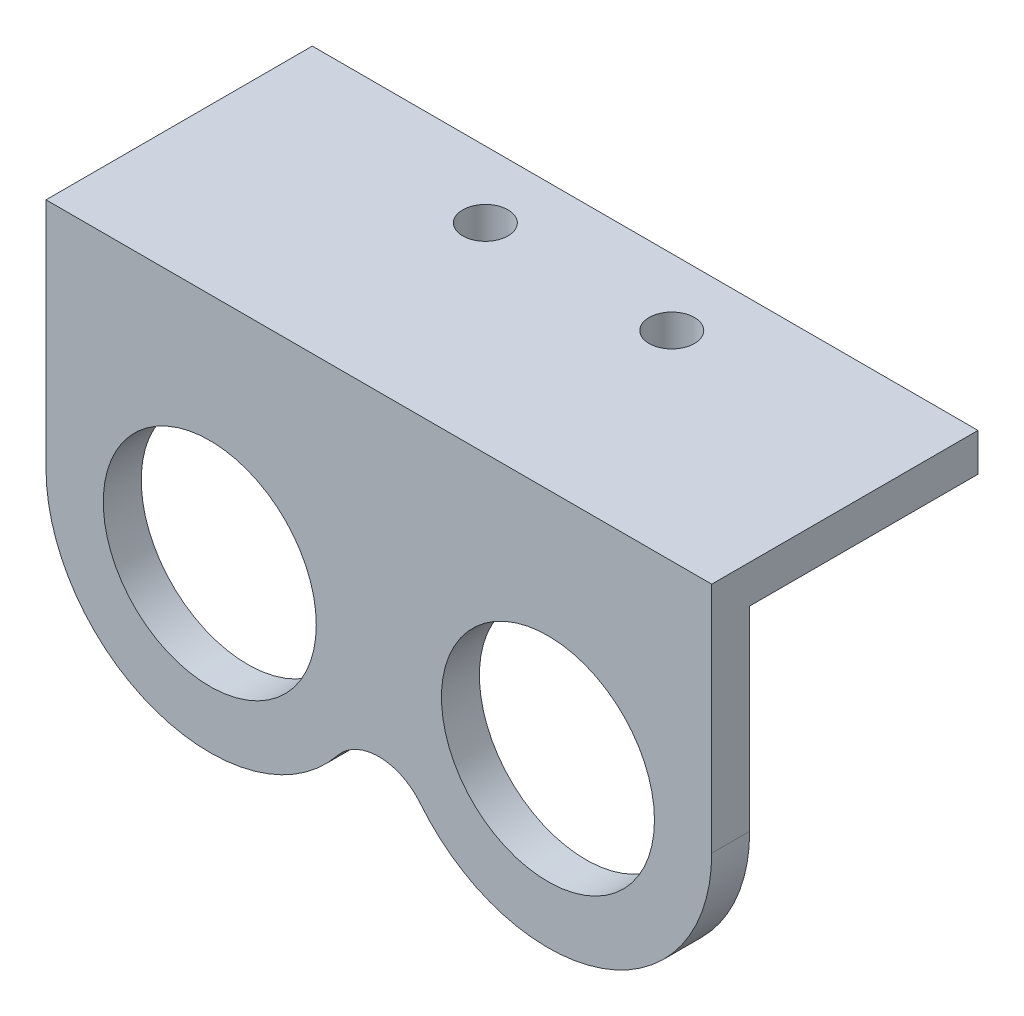
ISO-10303-21;
HEADER;
FILE_DESCRIPTION(('STEP AP214'),'2;1');
FILE_NAME('part.step','',(''),(''),'','','');
FILE_SCHEMA(('AUTOMOTIVE_DESIGN { 1 0 10303 214 1 1 1 1 }'));
ENDSEC;
DATA;
#1=APPLICATION_CONTEXT('core data for automotive mechanical design processes');
#2=APPLICATION_PROTOCOL_DEFINITION('international standard','automotive_design',2000,#1);
#3=PRODUCT_CONTEXT('',#1,'mechanical');
#4=PRODUCT('Part','Part','',(#3));
#5=PRODUCT_RELATED_PRODUCT_CATEGORY('part','',(#4));
#6=PRODUCT_DEFINITION_FORMATION('','',#4);
#7=PRODUCT_DEFINITION_CONTEXT('part definition',#1,'design');
#8=PRODUCT_DEFINITION('design','',#6,#7);
#9=PRODUCT_DEFINITION_SHAPE('','',#8);
#10=(LENGTH_UNIT() NAMED_UNIT(*) SI_UNIT(.MILLI.,.METRE.));
#11=(NAMED_UNIT(*) PLANE_ANGLE_UNIT() SI_UNIT($,.RADIAN.));
#12=(NAMED_UNIT(*) SI_UNIT($,.STERADIAN.) SOLID_ANGLE_UNIT());
#13=UNCERTAINTY_MEASURE_WITH_UNIT(LENGTH_MEASURE(1.E-05),#10,'distance_accuracy_value','');
#14=(GEOMETRIC_REPRESENTATION_CONTEXT(3) GLOBAL_UNCERTAINTY_ASSIGNED_CONTEXT((#13)) GLOBAL_UNIT_ASSIGNED_CONTEXT((#10,
#11,#12)) REPRESENTATION_CONTEXT('',''));
#15=CARTESIAN_POINT('',(0.,0.,0.));
#16=DIRECTION('',(0.,0.,1.));
#17=DIRECTION('',(1.,0.,0.));
#18=AXIS2_PLACEMENT_3D('',#15,#16,#17);
#19=CARTESIAN_POINT('',(-12.7,0.,0.));
#20=DIRECTION('',(0.,0.,1.));
#21=DIRECTION('',(1.,0.,0.));
#22=AXIS2_PLACEMENT_3D('',#19,#20,#21);
#23=PLANE('',#22);
#24=CARTESIAN_POINT('',(-12.7,0.,0.));
#25=DIRECTION('',(0.,0.,1.));
#26=DIRECTION('',(1.,0.,0.));
#27=AXIS2_PLACEMENT_3D('',#24,#25,#26);
#28=CIRCLE('',#27,8.);
#29=CARTESIAN_POINT('',(-4.7,0.,0.));
#30=VERTEX_POINT('',#29);
#31=EDGE_CURVE('E159',#30,#30,#28,.T.);
#32=ORIENTED_EDGE('',*,*,#31,.T.);
#33=EDGE_LOOP('',(#32));
#34=FACE_BOUND('',#33,.T.);
#35=CARTESIAN_POINT('',(12.7,0.,0.));
#36=DIRECTION('',(0.,0.,1.));
#37=DIRECTION('',(1.,0.,0.));
#38=AXIS2_PLACEMENT_3D('',#35,#36,#37);
#39=CIRCLE('',#38,8.);
#40=CARTESIAN_POINT('',(20.7,0.,0.));
#41=VERTEX_POINT('',#40);
#42=EDGE_CURVE('E180',#41,#41,#39,.T.);
#43=ORIENTED_EDGE('',*,*,#42,.T.);
#44=EDGE_LOOP('',(#43));
#45=FACE_BOUND('',#44,.T.);
#46=DIRECTION('',(-1.,0.,0.));
#47=VECTOR('',#46,1.);
#48=CARTESIAN_POINT('',(42.3851948507919,14.65,0.));
#49=LINE('',#48,#47);
#50=CARTESIAN_POINT('',(25.,14.65,0.));
#51=VERTEX_POINT('',#50);
#52=CARTESIAN_POINT('',(-25.,14.65,0.));
#53=VERTEX_POINT('',#52);
#54=EDGE_CURVE('E54',#51,#53,#49,.T.);
#55=ORIENTED_EDGE('',*,*,#54,.F.);
#56=DIRECTION('',(0.,1.,0.));
#57=VECTOR('',#56,1.);
#58=CARTESIAN_POINT('',(25.,0.,0.));
#59=LINE('',#58,#57);
#60=CARTESIAN_POINT('',(25.,0.,0.));
#61=VERTEX_POINT('',#60);
#62=EDGE_CURVE('E134',#61,#51,#59,.T.);
#63=ORIENTED_EDGE('',*,*,#62,.F.);
#64=CARTESIAN_POINT('',(12.7,0.,0.));
#65=DIRECTION('',(0.,0.,1.));
#66=DIRECTION('',(1.,0.,0.));
#67=AXIS2_PLACEMENT_3D('',#64,#65,#66);
#68=CIRCLE('',#67,12.3);
#69=CARTESIAN_POINT('',(3.11656441717792,-7.7102375080084,0.));
#70=VERTEX_POINT('',#69);
#71=EDGE_CURVE('E85',#70,#61,#68,.T.);
#72=ORIENTED_EDGE('',*,*,#71,.F.);
#73=CARTESIAN_POINT('',(0.,-10.2176318195558,0.));
#74=DIRECTION('',(0.,0.,-1.));
#75=DIRECTION('',(-1.,0.,0.));
#76=AXIS2_PLACEMENT_3D('',#73,#74,#75);
#77=CIRCLE('',#76,4.);
#78=CARTESIAN_POINT('',(-3.11656441717791,-7.7102375080084,0.));
#79=VERTEX_POINT('',#78);
#80=EDGE_CURVE('E117',#79,#70,#77,.T.);
#81=ORIENTED_EDGE('',*,*,#80,.F.);
#82=CARTESIAN_POINT('',(-12.7,0.,0.));
#83=DIRECTION('',(0.,0.,1.));
#84=DIRECTION('',(1.,0.,0.));
#85=AXIS2_PLACEMENT_3D('',#82,#83,#84);
#86=CIRCLE('',#85,12.3);
#87=CARTESIAN_POINT('',(-25.,0.,0.));
#88=VERTEX_POINT('',#87);
#89=EDGE_CURVE('E129',#88,#79,#86,.T.);
#90=ORIENTED_EDGE('',*,*,#89,.F.);
#91=DIRECTION('',(0.,-1.,0.));
#92=VECTOR('',#91,1.);
#93=CARTESIAN_POINT('',(-25.,17.5,0.));
#94=LINE('',#93,#92);
#95=EDGE_CURVE('E127',#53,#88,#94,.T.);
#96=ORIENTED_EDGE('',*,*,#95,.F.);
#97=EDGE_LOOP('',(#55,#63,#72,#81,#90,#96));
#98=FACE_BOUND('',#97,.T.);
#99=ADVANCED_FACE('F39',(#34,#45,#98),#23,.F.);
#100=CARTESIAN_POINT('',(-12.7,0.,2.85));
#101=DIRECTION('',(0.,0.,1.));
#102=DIRECTION('',(1.,0.,0.));
#103=AXIS2_PLACEMENT_3D('',#100,#101,#102);
#104=PLANE('',#103);
#105=CARTESIAN_POINT('',(12.7,0.,2.85));
#106=DIRECTION('',(0.,0.,1.));
#107=DIRECTION('',(1.,0.,0.));
#108=AXIS2_PLACEMENT_3D('',#105,#106,#107);
#109=CIRCLE('',#108,8.);
#110=CARTESIAN_POINT('',(20.7,0.,2.85));
#111=VERTEX_POINT('',#110);
#112=EDGE_CURVE('E130',#111,#111,#109,.T.);
#113=ORIENTED_EDGE('',*,*,#112,.F.);
#114=EDGE_LOOP('',(#113));
#115=FACE_BOUND('',#114,.T.);
#116=DIRECTION('',(-1.,0.,0.));
#117=VECTOR('',#116,1.);
#118=CARTESIAN_POINT('',(25.,17.5,2.85));
#119=LINE('',#118,#117);
#120=CARTESIAN_POINT('',(25.,17.5,2.85));
#121=VERTEX_POINT('',#120);
#122=CARTESIAN_POINT('',(-25.,17.5,2.85));
#123=VERTEX_POINT('',#122);
#124=EDGE_CURVE('E136',#121,#123,#119,.T.);
#125=ORIENTED_EDGE('',*,*,#124,.T.);
#126=DIRECTION('',(0.,-1.,0.));
#127=VECTOR('',#126,1.);
#128=CARTESIAN_POINT('',(-25.,17.5,2.85));
#129=LINE('',#128,#127);
#130=CARTESIAN_POINT('',(-25.,0.,2.85));
#131=VERTEX_POINT('',#130);
#132=EDGE_CURVE('E93',#123,#131,#129,.T.);
#133=ORIENTED_EDGE('',*,*,#132,.T.);
#134=CARTESIAN_POINT('',(-12.7,0.,2.85));
#135=DIRECTION('',(0.,0.,1.));
#136=DIRECTION('',(1.,0.,0.));
#137=AXIS2_PLACEMENT_3D('',#134,#135,#136);
#138=CIRCLE('',#137,12.3);
#139=CARTESIAN_POINT('',(-3.11656441717791,-7.7102375080084,2.85));
#140=VERTEX_POINT('',#139);
#141=EDGE_CURVE('E109',#131,#140,#138,.T.);
#142=ORIENTED_EDGE('',*,*,#141,.T.);
#143=CARTESIAN_POINT('',(0.,-10.2176318195558,2.85));
#144=DIRECTION('',(0.,0.,-1.));
#145=DIRECTION('',(-1.,0.,0.));
#146=AXIS2_PLACEMENT_3D('',#143,#144,#145);
#147=CIRCLE('',#146,4.);
#148=CARTESIAN_POINT('',(3.11656441717792,-7.7102375080084,2.85));
#149=VERTEX_POINT('',#148);
#150=EDGE_CURVE('E102',#140,#149,#147,.T.);
#151=ORIENTED_EDGE('',*,*,#150,.T.);
#152=CARTESIAN_POINT('',(12.7,0.,2.85));
#153=DIRECTION('',(0.,0.,1.));
#154=DIRECTION('',(1.,0.,0.));
#155=AXIS2_PLACEMENT_3D('',#152,#153,#154);
#156=CIRCLE('',#155,12.3);
#157=CARTESIAN_POINT('',(25.,0.,2.85));
#158=VERTEX_POINT('',#157);
#159=EDGE_CURVE('E107',#149,#158,#156,.T.);
#160=ORIENTED_EDGE('',*,*,#159,.T.);
#161=DIRECTION('',(0.,1.,0.));
#162=VECTOR('',#161,1.);
#163=CARTESIAN_POINT('',(25.,0.,2.85));
#164=LINE('',#163,#162);
#165=EDGE_CURVE('E63',#158,#121,#164,.T.);
#166=ORIENTED_EDGE('',*,*,#165,.T.);
#167=EDGE_LOOP('',(#125,#133,#142,#151,#160,#166));
#168=FACE_BOUND('',#167,.T.);
#169=CARTESIAN_POINT('',(-12.7,0.,2.85));
#170=DIRECTION('',(0.,0.,1.));
#171=DIRECTION('',(1.,0.,0.));
#172=AXIS2_PLACEMENT_3D('',#169,#170,#171);
#173=CIRCLE('',#172,8.);
#174=CARTESIAN_POINT('',(-4.7,0.,2.85));
#175=VERTEX_POINT('',#174);
#176=EDGE_CURVE('E163',#175,#175,#173,.T.);
#177=ORIENTED_EDGE('',*,*,#176,.F.);
#178=EDGE_LOOP('',(#177));
#179=FACE_BOUND('',#178,.T.);
#180=ADVANCED_FACE('F104',(#115,#168,#179),#104,.T.);
#181=CARTESIAN_POINT('',(25.,17.5,2.85));
#182=DIRECTION('',(0.,-1.,0.));
#183=DIRECTION('',(1.,0.,0.));
#184=AXIS2_PLACEMENT_3D('',#181,#182,#183);
#185=PLANE('',#184);
#186=CARTESIAN_POINT('',(-7.,17.5,-12.15));
#187=DIRECTION('',(0.,1.,0.));
#188=DIRECTION('',(-1.,0.,0.));
#189=AXIS2_PLACEMENT_3D('',#186,#187,#188);
#190=CIRCLE('',#189,1.7);
#191=CARTESIAN_POINT('',(-8.7,17.5,-12.15));
#192=VERTEX_POINT('',#191);
#193=EDGE_CURVE('E245',#192,#192,#190,.T.);
#194=ORIENTED_EDGE('',*,*,#193,.F.);
#195=EDGE_LOOP('',(#194));
#196=FACE_BOUND('',#195,.T.);
#197=CARTESIAN_POINT('',(7.,17.5,-12.15));
#198=DIRECTION('',(0.,1.,0.));
#199=DIRECTION('',(-1.,0.,0.));
#200=AXIS2_PLACEMENT_3D('',#197,#198,#199);
#201=CIRCLE('',#200,1.7);
#202=CARTESIAN_POINT('',(5.3,17.5,-12.15));
#203=VERTEX_POINT('',#202);
#204=EDGE_CURVE('E248',#203,#203,#201,.T.);
#205=ORIENTED_EDGE('',*,*,#204,.F.);
#206=EDGE_LOOP('',(#205));
#207=FACE_BOUND('',#206,.T.);
#208=DIRECTION('',(0.,0.,-1.));
#209=VECTOR('',#208,1.);
#210=CARTESIAN_POINT('',(25.,17.5,2.85));
#211=LINE('',#210,#209);
#212=CARTESIAN_POINT('',(25.,17.5,-17.15));
#213=VERTEX_POINT('',#212);
#214=EDGE_CURVE('E123',#121,#213,#211,.T.);
#215=ORIENTED_EDGE('',*,*,#214,.T.);
#216=DIRECTION('',(-1.,0.,0.));
#217=VECTOR('',#216,1.);
#218=CARTESIAN_POINT('',(42.3851948507919,17.5,-17.15));
#219=LINE('',#218,#217);
#220=CARTESIAN_POINT('',(-25.,17.5,-17.15));
#221=VERTEX_POINT('',#220);
#222=EDGE_CURVE('E174',#213,#221,#219,.T.);
#223=ORIENTED_EDGE('',*,*,#222,.T.);
#224=DIRECTION('',(0.,0.,-1.));
#225=VECTOR('',#224,1.);
#226=CARTESIAN_POINT('',(-25.,17.5,2.85));
#227=LINE('',#226,#225);
#228=EDGE_CURVE('E11',#123,#221,#227,.T.);
#229=ORIENTED_EDGE('',*,*,#228,.F.);
#230=ORIENTED_EDGE('',*,*,#124,.F.);
#231=EDGE_LOOP('',(#215,#223,#229,#230));
#232=FACE_BOUND('',#231,.T.);
#233=ADVANCED_FACE('F41',(#196,#207,#232),#185,.F.);
#234=CARTESIAN_POINT('',(-25.,17.5,2.85));
#235=DIRECTION('',(1.,0.,0.));
#236=DIRECTION('',(0.,1.,0.));
#237=AXIS2_PLACEMENT_3D('',#234,#235,#236);
#238=PLANE('',#237);
#239=ORIENTED_EDGE('',*,*,#228,.T.);
#240=DIRECTION('',(0.,-1.,0.));
#241=VECTOR('',#240,1.);
#242=CARTESIAN_POINT('',(-25.,17.5,-17.15));
#243=LINE('',#242,#241);
#244=CARTESIAN_POINT('',(-25.,14.65,-17.15));
#245=VERTEX_POINT('',#244);
#246=EDGE_CURVE('E168',#221,#245,#243,.T.);
#247=ORIENTED_EDGE('',*,*,#246,.T.);
#248=DIRECTION('',(0.,0.,1.));
#249=VECTOR('',#248,1.);
#250=CARTESIAN_POINT('',(-25.,14.65,0.));
#251=LINE('',#250,#249);
#252=EDGE_CURVE('E171',#245,#53,#251,.T.);
#253=ORIENTED_EDGE('',*,*,#252,.T.);
#254=ORIENTED_EDGE('',*,*,#95,.T.);
#255=DIRECTION('',(0.,0.,-1.));
#256=VECTOR('',#255,1.);
#257=CARTESIAN_POINT('',(-25.,0.,2.85));
#258=LINE('',#257,#256);
#259=EDGE_CURVE('E47',#131,#88,#258,.T.);
#260=ORIENTED_EDGE('',*,*,#259,.F.);
#261=ORIENTED_EDGE('',*,*,#132,.F.);
#262=EDGE_LOOP('',(#239,#247,#253,#254,#260,#261));
#263=FACE_BOUND('',#262,.T.);
#264=ADVANCED_FACE('F193',(#263),#238,.F.);
#265=CARTESIAN_POINT('',(-12.7,0.,2.85));
#266=DIRECTION('',(0.,0.,-1.));
#267=DIRECTION('',(-1.,0.,0.));
#268=AXIS2_PLACEMENT_3D('',#265,#266,#267);
#269=CYLINDRICAL_SURFACE('',#268,12.3);
#270=ORIENTED_EDGE('',*,*,#89,.T.);
#271=DIRECTION('',(0.,0.,-1.));
#272=VECTOR('',#271,1.);
#273=CARTESIAN_POINT('',(-3.11656441717791,-7.7102375080084,2.85));
#274=LINE('',#273,#272);
#275=EDGE_CURVE('E118',#140,#79,#274,.T.);
#276=ORIENTED_EDGE('',*,*,#275,.F.);
#277=ORIENTED_EDGE('',*,*,#141,.F.);
#278=ORIENTED_EDGE('',*,*,#259,.T.);
#279=EDGE_LOOP('',(#270,#276,#277,#278));
#280=FACE_BOUND('',#279,.T.);
#281=ADVANCED_FACE('F143',(#280),#269,.T.);
#282=CARTESIAN_POINT('',(0.,-10.2176318195558,2.85));
#283=DIRECTION('',(0.,0.,-1.));
#284=DIRECTION('',(-1.,0.,0.));
#285=AXIS2_PLACEMENT_3D('',#282,#283,#284);
#286=CYLINDRICAL_SURFACE('',#285,4.);
#287=ORIENTED_EDGE('',*,*,#80,.T.);
#288=DIRECTION('',(0.,0.,-1.));
#289=VECTOR('',#288,1.);
#290=CARTESIAN_POINT('',(3.11656441717792,-7.7102375080084,2.85));
#291=LINE('',#290,#289);
#292=EDGE_CURVE('E114',#149,#70,#291,.T.);
#293=ORIENTED_EDGE('',*,*,#292,.F.);
#294=ORIENTED_EDGE('',*,*,#150,.F.);
#295=ORIENTED_EDGE('',*,*,#275,.T.);
#296=EDGE_LOOP('',(#287,#293,#294,#295));
#297=FACE_BOUND('',#296,.T.);
#298=ADVANCED_FACE('F115',(#297),#286,.F.);
#299=CARTESIAN_POINT('',(12.7,0.,2.85));
#300=DIRECTION('',(0.,0.,-1.));
#301=DIRECTION('',(-1.,0.,0.));
#302=AXIS2_PLACEMENT_3D('',#299,#300,#301);
#303=CYLINDRICAL_SURFACE('',#302,12.3);
#304=ORIENTED_EDGE('',*,*,#71,.T.);
#305=DIRECTION('',(0.,0.,-1.));
#306=VECTOR('',#305,1.);
#307=CARTESIAN_POINT('',(25.,0.,2.85));
#308=LINE('',#307,#306);
#309=EDGE_CURVE('E119',#158,#61,#308,.T.);
#310=ORIENTED_EDGE('',*,*,#309,.F.);
#311=ORIENTED_EDGE('',*,*,#159,.F.);
#312=ORIENTED_EDGE('',*,*,#292,.T.);
#313=EDGE_LOOP('',(#304,#310,#311,#312));
#314=FACE_BOUND('',#313,.T.);
#315=ADVANCED_FACE('F121',(#314),#303,.T.);
#316=CARTESIAN_POINT('',(25.,0.,2.85));
#317=DIRECTION('',(-1.,0.,0.));
#318=DIRECTION('',(0.,-1.,0.));
#319=AXIS2_PLACEMENT_3D('',#316,#317,#318);
#320=PLANE('',#319);
#321=ORIENTED_EDGE('',*,*,#62,.T.);
#322=DIRECTION('',(0.,0.,-1.));
#323=VECTOR('',#322,1.);
#324=CARTESIAN_POINT('',(25.,14.65,0.));
#325=LINE('',#324,#323);
#326=CARTESIAN_POINT('',(25.,14.65,-17.15));
#327=VERTEX_POINT('',#326);
#328=EDGE_CURVE('E150',#51,#327,#325,.T.);
#329=ORIENTED_EDGE('',*,*,#328,.T.);
#330=DIRECTION('',(0.,1.,0.));
#331=VECTOR('',#330,1.);
#332=CARTESIAN_POINT('',(25.,17.5,-17.15));
#333=LINE('',#332,#331);
#334=EDGE_CURVE('E160',#327,#213,#333,.T.);
#335=ORIENTED_EDGE('',*,*,#334,.T.);
#336=ORIENTED_EDGE('',*,*,#214,.F.);
#337=ORIENTED_EDGE('',*,*,#165,.F.);
#338=ORIENTED_EDGE('',*,*,#309,.T.);
#339=EDGE_LOOP('',(#321,#329,#335,#336,#337,#338));
#340=FACE_BOUND('',#339,.T.);
#341=ADVANCED_FACE('F148',(#340),#320,.F.);
#342=CARTESIAN_POINT('',(12.7,0.,2.85));
#343=DIRECTION('',(0.,0.,-1.));
#344=DIRECTION('',(-1.,0.,0.));
#345=AXIS2_PLACEMENT_3D('',#342,#343,#344);
#346=CYLINDRICAL_SURFACE('',#345,8.);
#347=ORIENTED_EDGE('',*,*,#112,.T.);
#348=EDGE_LOOP('',(#347));
#349=FACE_BOUND('',#348,.T.);
#350=ORIENTED_EDGE('',*,*,#42,.F.);
#351=EDGE_LOOP('',(#350));
#352=FACE_BOUND('',#351,.T.);
#353=ADVANCED_FACE('F231',(#349,#352),#346,.F.);
#354=CARTESIAN_POINT('',(-12.7,0.,2.85));
#355=DIRECTION('',(0.,0.,-1.));
#356=DIRECTION('',(-1.,0.,0.));
#357=AXIS2_PLACEMENT_3D('',#354,#355,#356);
#358=CYLINDRICAL_SURFACE('',#357,8.);
#359=ORIENTED_EDGE('',*,*,#176,.T.);
#360=EDGE_LOOP('',(#359));
#361=FACE_BOUND('',#360,.T.);
#362=ORIENTED_EDGE('',*,*,#31,.F.);
#363=EDGE_LOOP('',(#362));
#364=FACE_BOUND('',#363,.T.);
#365=ADVANCED_FACE('F213',(#361,#364),#358,.F.);
#366=CARTESIAN_POINT('',(42.3851948507919,14.65,0.));
#367=DIRECTION('',(0.,-1.,0.));
#368=DIRECTION('',(0.,0.,-1.));
#369=AXIS2_PLACEMENT_3D('',#366,#367,#368);
#370=PLANE('',#369);
#371=CARTESIAN_POINT('',(-7.,14.65,-12.15));
#372=DIRECTION('',(0.,-1.,0.));
#373=DIRECTION('',(0.,0.,-1.));
#374=AXIS2_PLACEMENT_3D('',#371,#372,#373);
#375=CIRCLE('',#374,1.7);
#376=CARTESIAN_POINT('',(-7.,14.65,-13.85));
#377=VERTEX_POINT('',#376);
#378=EDGE_CURVE('E172',#377,#377,#375,.F.);
#379=ORIENTED_EDGE('',*,*,#378,.T.);
#380=EDGE_LOOP('',(#379));
#381=FACE_BOUND('',#380,.T.);
#382=CARTESIAN_POINT('',(7.,14.65,-12.15));
#383=DIRECTION('',(0.,-1.,0.));
#384=DIRECTION('',(0.,0.,-1.));
#385=AXIS2_PLACEMENT_3D('',#382,#383,#384);
#386=CIRCLE('',#385,1.7);
#387=CARTESIAN_POINT('',(7.,14.65,-13.85));
#388=VERTEX_POINT('',#387);
#389=EDGE_CURVE('E249',#388,#388,#386,.F.);
#390=ORIENTED_EDGE('',*,*,#389,.T.);
#391=EDGE_LOOP('',(#390));
#392=FACE_BOUND('',#391,.T.);
#393=ORIENTED_EDGE('',*,*,#328,.F.);
#394=ORIENTED_EDGE('',*,*,#54,.T.);
#395=ORIENTED_EDGE('',*,*,#252,.F.);
#396=DIRECTION('',(-1.,0.,0.));
#397=VECTOR('',#396,1.);
#398=CARTESIAN_POINT('',(42.3851948507919,14.65,-17.15));
#399=LINE('',#398,#397);
#400=EDGE_CURVE('E158',#327,#245,#399,.T.);
#401=ORIENTED_EDGE('',*,*,#400,.F.);
#402=EDGE_LOOP('',(#393,#394,#395,#401));
#403=FACE_BOUND('',#402,.T.);
#404=ADVANCED_FACE('F154',(#381,#392,#403),#370,.T.);
#405=CARTESIAN_POINT('',(42.3851948507919,17.5,-17.15));
#406=DIRECTION('',(0.,0.,-1.));
#407=DIRECTION('',(-1.,0.,0.));
#408=AXIS2_PLACEMENT_3D('',#405,#406,#407);
#409=PLANE('',#408);
#410=ORIENTED_EDGE('',*,*,#334,.F.);
#411=ORIENTED_EDGE('',*,*,#400,.T.);
#412=ORIENTED_EDGE('',*,*,#246,.F.);
#413=ORIENTED_EDGE('',*,*,#222,.F.);
#414=EDGE_LOOP('',(#410,#411,#412,#413));
#415=FACE_BOUND('',#414,.T.);
#416=ADVANCED_FACE('F200',(#415),#409,.T.);
#417=CARTESIAN_POINT('',(7.,9.84167388793147,-12.15));
#418=DIRECTION('',(0.,1.,0.));
#419=DIRECTION('',(-1.,0.,0.));
#420=AXIS2_PLACEMENT_3D('',#417,#418,#419);
#421=CYLINDRICAL_SURFACE('',#420,1.7);
#422=ORIENTED_EDGE('',*,*,#204,.T.);
#423=EDGE_LOOP('',(#422));
#424=FACE_BOUND('',#423,.T.);
#425=ORIENTED_EDGE('',*,*,#389,.F.);
#426=EDGE_LOOP('',(#425));
#427=FACE_BOUND('',#426,.T.);
#428=ADVANCED_FACE('F202',(#424,#427),#421,.F.);
#429=CARTESIAN_POINT('',(-7.,9.84167388793147,-12.15));
#430=DIRECTION('',(0.,1.,0.));
#431=DIRECTION('',(-1.,0.,0.));
#432=AXIS2_PLACEMENT_3D('',#429,#430,#431);
#433=CYLINDRICAL_SURFACE('',#432,1.7);
#434=ORIENTED_EDGE('',*,*,#193,.T.);
#435=EDGE_LOOP('',(#434));
#436=FACE_BOUND('',#435,.T.);
#437=ORIENTED_EDGE('',*,*,#378,.F.);
#438=EDGE_LOOP('',(#437));
#439=FACE_BOUND('',#438,.T.);
#440=ADVANCED_FACE('F209',(#436,#439),#433,.F.);
#441=CLOSED_SHELL('',(#99,#180,#233,#264,#281,#298,#315,#341,#353,#365,#404,#416,#428,#440));
#442=MANIFOLD_SOLID_BREP('B2',#441);
#443=ADVANCED_BREP_SHAPE_REPRESENTATION('',(#18,#442),#14);
#444=SHAPE_DEFINITION_REPRESENTATION(#9,#443);
ENDSEC;
END-ISO-10303-21;
